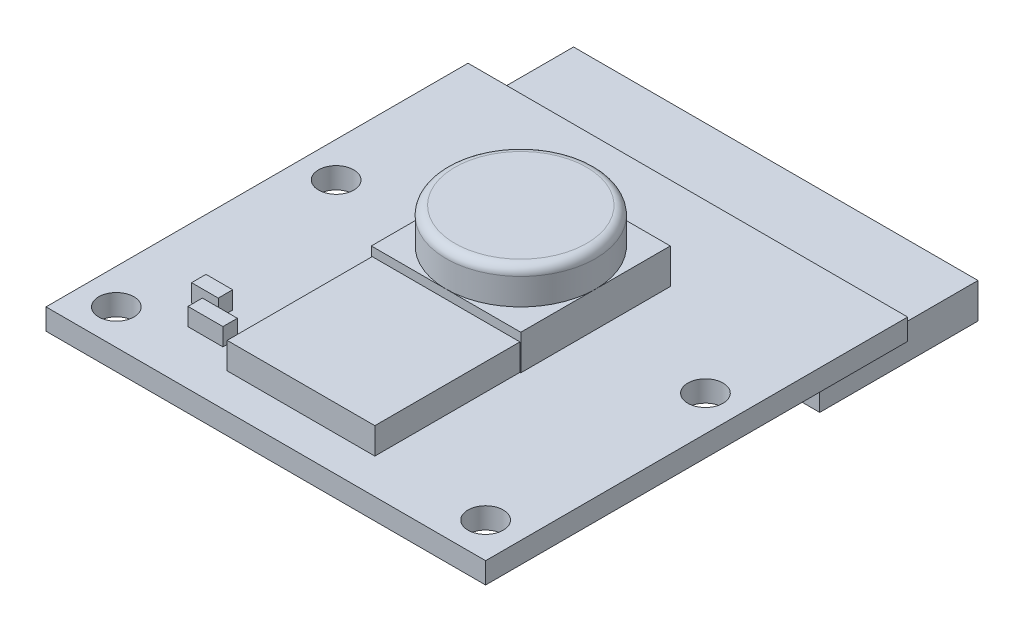
ISO-10303-21;
HEADER;
FILE_DESCRIPTION(('STEP AP214'),'2;1');
FILE_NAME('part.step','',(''),(''),'','','');
FILE_SCHEMA(('AUTOMOTIVE_DESIGN { 1 0 10303 214 1 1 1 1 }'));
ENDSEC;
DATA;
#1=APPLICATION_CONTEXT('core data for automotive mechanical design processes');
#2=APPLICATION_PROTOCOL_DEFINITION('international standard','automotive_design',2000,#1);
#3=PRODUCT_CONTEXT('',#1,'mechanical');
#4=PRODUCT('Part','Part','',(#3));
#5=PRODUCT_RELATED_PRODUCT_CATEGORY('part','',(#4));
#6=PRODUCT_DEFINITION_FORMATION('','',#4);
#7=PRODUCT_DEFINITION_CONTEXT('part definition',#1,'design');
#8=PRODUCT_DEFINITION('design','',#6,#7);
#9=PRODUCT_DEFINITION_SHAPE('','',#8);
#10=(LENGTH_UNIT() NAMED_UNIT(*) SI_UNIT(.MILLI.,.METRE.));
#11=(NAMED_UNIT(*) PLANE_ANGLE_UNIT() SI_UNIT($,.RADIAN.));
#12=(NAMED_UNIT(*) SI_UNIT($,.STERADIAN.) SOLID_ANGLE_UNIT());
#13=UNCERTAINTY_MEASURE_WITH_UNIT(LENGTH_MEASURE(1.E-05),#10,'distance_accuracy_value','');
#14=(GEOMETRIC_REPRESENTATION_CONTEXT(3) GLOBAL_UNCERTAINTY_ASSIGNED_CONTEXT((#13)) GLOBAL_UNIT_ASSIGNED_CONTEXT((#10,
#11,#12)) REPRESENTATION_CONTEXT('',''));
#15=CARTESIAN_POINT('',(0.,0.,0.));
#16=DIRECTION('',(0.,0.,1.));
#17=DIRECTION('',(1.,0.,0.));
#18=AXIS2_PLACEMENT_3D('',#15,#16,#17);
#19=CARTESIAN_POINT('',(0.,3.2,0.));
#20=DIRECTION('',(0.,-1.,0.));
#21=DIRECTION('',(0.,0.,-1.));
#22=AXIS2_PLACEMENT_3D('',#19,#20,#21);
#23=PLANE('',#22);
#24=DIRECTION('',(-1.,0.,0.));
#25=VECTOR('',#24,1.);
#26=CARTESIAN_POINT('',(0.,3.2,-18.75));
#27=LINE('',#26,#25);
#28=CARTESIAN_POINT('',(16.75,3.2,-18.75));
#29=VERTEX_POINT('',#28);
#30=CARTESIAN_POINT('',(12.5,3.2,-18.75));
#31=VERTEX_POINT('',#30);
#32=EDGE_CURVE('E234',#29,#31,#27,.T.);
#33=ORIENTED_EDGE('',*,*,#32,.T.);
#34=CARTESIAN_POINT('',(12.5,3.2,-14.5));
#35=DIRECTION('',(0.,-1.,0.));
#36=DIRECTION('',(0.,0.,-1.));
#37=AXIS2_PLACEMENT_3D('',#34,#35,#36);
#38=CIRCLE('',#37,4.25);
#39=CARTESIAN_POINT('',(16.75,3.2,-14.5));
#40=VERTEX_POINT('',#39);
#41=EDGE_CURVE('E55',#31,#40,#38,.T.);
#42=ORIENTED_EDGE('',*,*,#41,.T.);
#43=DIRECTION('',(0.,0.,-1.));
#44=VECTOR('',#43,1.);
#45=CARTESIAN_POINT('',(16.75,3.2,0.));
#46=LINE('',#45,#44);
#47=EDGE_CURVE('E231',#40,#29,#46,.T.);
#48=ORIENTED_EDGE('',*,*,#47,.T.);
#49=EDGE_LOOP('',(#33,#42,#48));
#50=FACE_BOUND('',#49,.T.);
#51=ADVANCED_FACE('F40',(#50),#23,.F.);
#52=CARTESIAN_POINT('',(16.75,3.2,-10.25));
#53=VERTEX_POINT('',#52);
#54=EDGE_CURVE('E240',#53,#40,#46,.T.);
#55=ORIENTED_EDGE('',*,*,#54,.T.);
#56=CARTESIAN_POINT('',(12.5,3.2,-10.25));
#57=VERTEX_POINT('',#56);
#58=EDGE_CURVE('E219',#40,#57,#38,.T.);
#59=ORIENTED_EDGE('',*,*,#58,.T.);
#60=DIRECTION('',(-1.,0.,0.));
#61=VECTOR('',#60,1.);
#62=CARTESIAN_POINT('',(0.,3.2,-10.25));
#63=LINE('',#62,#61);
#64=EDGE_CURVE('E246',#53,#57,#63,.T.);
#65=ORIENTED_EDGE('',*,*,#64,.F.);
#66=EDGE_LOOP('',(#55,#59,#65));
#67=FACE_BOUND('',#66,.T.);
#68=ADVANCED_FACE('F244',(#67),#23,.F.);
#69=CARTESIAN_POINT('',(8.25,3.2,-10.25));
#70=VERTEX_POINT('',#69);
#71=EDGE_CURVE('E265',#57,#70,#63,.T.);
#72=ORIENTED_EDGE('',*,*,#71,.F.);
#73=CARTESIAN_POINT('',(8.25,3.2,-14.5));
#74=VERTEX_POINT('',#73);
#75=EDGE_CURVE('E222',#57,#74,#38,.T.);
#76=ORIENTED_EDGE('',*,*,#75,.T.);
#77=DIRECTION('',(0.,0.,-1.));
#78=VECTOR('',#77,1.);
#79=CARTESIAN_POINT('',(8.25,3.2,0.));
#80=LINE('',#79,#78);
#81=EDGE_CURVE('E403',#70,#74,#80,.T.);
#82=ORIENTED_EDGE('',*,*,#81,.F.);
#83=EDGE_LOOP('',(#72,#76,#82));
#84=FACE_BOUND('',#83,.T.);
#85=ADVANCED_FACE('F375',(#84),#23,.F.);
#86=CARTESIAN_POINT('',(0.,0.,0.));
#87=DIRECTION('',(0.,1.,0.));
#88=DIRECTION('',(0.,0.,1.));
#89=AXIS2_PLACEMENT_3D('',#86,#87,#88);
#90=PLANE('',#89);
#91=CARTESIAN_POINT('',(2.,0.,-2.));
#92=DIRECTION('',(0.,1.,0.));
#93=DIRECTION('',(0.,0.,1.));
#94=AXIS2_PLACEMENT_3D('',#91,#92,#93);
#95=CIRCLE('',#94,1.);
#96=CARTESIAN_POINT('',(2.,0.,-1.));
#97=VERTEX_POINT('',#96);
#98=EDGE_CURVE('E304',#97,#97,#95,.T.);
#99=ORIENTED_EDGE('',*,*,#98,.T.);
#100=EDGE_LOOP('',(#99));
#101=FACE_BOUND('',#100,.T.);
#102=CARTESIAN_POINT('',(23.,0.,-2.));
#103=DIRECTION('',(0.,1.,0.));
#104=DIRECTION('',(0.,0.,1.));
#105=AXIS2_PLACEMENT_3D('',#102,#103,#104);
#106=CIRCLE('',#105,1.);
#107=CARTESIAN_POINT('',(23.,0.,-1.));
#108=VERTEX_POINT('',#107);
#109=EDGE_CURVE('E342',#108,#108,#106,.T.);
#110=ORIENTED_EDGE('',*,*,#109,.T.);
#111=EDGE_LOOP('',(#110));
#112=FACE_BOUND('',#111,.T.);
#113=CARTESIAN_POINT('',(2.,0.,-14.5));
#114=DIRECTION('',(0.,1.,0.));
#115=DIRECTION('',(0.,0.,1.));
#116=AXIS2_PLACEMENT_3D('',#113,#114,#115);
#117=CIRCLE('',#116,1.);
#118=CARTESIAN_POINT('',(2.,0.,-13.5));
#119=VERTEX_POINT('',#118);
#120=EDGE_CURVE('E339',#119,#119,#117,.T.);
#121=ORIENTED_EDGE('',*,*,#120,.T.);
#122=EDGE_LOOP('',(#121));
#123=FACE_BOUND('',#122,.T.);
#124=CARTESIAN_POINT('',(23.,0.,-14.5));
#125=DIRECTION('',(0.,1.,0.));
#126=DIRECTION('',(0.,0.,1.));
#127=AXIS2_PLACEMENT_3D('',#124,#125,#126);
#128=CIRCLE('',#127,1.);
#129=CARTESIAN_POINT('',(23.,0.,-13.5));
#130=VERTEX_POINT('',#129);
#131=EDGE_CURVE('E336',#130,#130,#128,.T.);
#132=ORIENTED_EDGE('',*,*,#131,.T.);
#133=EDGE_LOOP('',(#132));
#134=FACE_BOUND('',#133,.T.);
#135=DIRECTION('',(0.,0.,1.));
#136=VECTOR('',#135,1.);
#137=CARTESIAN_POINT('',(24.,0.,0.));
#138=LINE('',#137,#136);
#139=CARTESIAN_POINT('',(24.,0.,-24.));
#140=VERTEX_POINT('',#139);
#141=CARTESIAN_POINT('',(24.,0.,-20.));
#142=VERTEX_POINT('',#141);
#143=EDGE_CURVE('E516',#140,#142,#138,.T.);
#144=ORIENTED_EDGE('',*,*,#143,.F.);
#145=DIRECTION('',(1.,0.,0.));
#146=VECTOR('',#145,1.);
#147=CARTESIAN_POINT('',(0.,0.,-24.));
#148=LINE('',#147,#146);
#149=CARTESIAN_POINT('',(25.,0.,-24.));
#150=VERTEX_POINT('',#149);
#151=EDGE_CURVE('E299',#140,#150,#148,.T.);
#152=ORIENTED_EDGE('',*,*,#151,.T.);
#153=DIRECTION('',(0.,0.,1.));
#154=VECTOR('',#153,1.);
#155=CARTESIAN_POINT('',(25.,0.,0.));
#156=LINE('',#155,#154);
#157=CARTESIAN_POINT('',(25.,0.,0.));
#158=VERTEX_POINT('',#157);
#159=EDGE_CURVE('E333',#150,#158,#156,.T.);
#160=ORIENTED_EDGE('',*,*,#159,.T.);
#161=DIRECTION('',(1.,0.,0.));
#162=VECTOR('',#161,1.);
#163=CARTESIAN_POINT('',(0.,0.,0.));
#164=LINE('',#163,#162);
#165=CARTESIAN_POINT('',(0.,0.,0.));
#166=VERTEX_POINT('',#165);
#167=EDGE_CURVE('E330',#166,#158,#164,.T.);
#168=ORIENTED_EDGE('',*,*,#167,.F.);
#169=DIRECTION('',(0.,0.,1.));
#170=VECTOR('',#169,1.);
#171=CARTESIAN_POINT('',(0.,0.,0.));
#172=LINE('',#171,#170);
#173=CARTESIAN_POINT('',(0.,0.,-24.));
#174=VERTEX_POINT('',#173);
#175=EDGE_CURVE('E327',#174,#166,#172,.T.);
#176=ORIENTED_EDGE('',*,*,#175,.F.);
#177=CARTESIAN_POINT('',(1.,0.,-24.));
#178=VERTEX_POINT('',#177);
#179=EDGE_CURVE('E324',#174,#178,#148,.T.);
#180=ORIENTED_EDGE('',*,*,#179,.T.);
#181=DIRECTION('',(0.,0.,1.));
#182=VECTOR('',#181,1.);
#183=CARTESIAN_POINT('',(1.,0.,0.));
#184=LINE('',#183,#182);
#185=CARTESIAN_POINT('',(1.,0.,-20.));
#186=VERTEX_POINT('',#185);
#187=EDGE_CURVE('E355',#178,#186,#184,.T.);
#188=ORIENTED_EDGE('',*,*,#187,.T.);
#189=DIRECTION('',(1.,0.,0.));
#190=VECTOR('',#189,1.);
#191=CARTESIAN_POINT('',(0.,0.,-20.));
#192=LINE('',#191,#190);
#193=EDGE_CURVE('E505',#186,#142,#192,.T.);
#194=ORIENTED_EDGE('',*,*,#193,.T.);
#195=EDGE_LOOP('',(#144,#152,#160,#168,#176,#180,#188,#194));
#196=FACE_BOUND('',#195,.T.);
#197=ADVANCED_FACE('F393',(#101,#112,#123,#134,#196),#90,.F.);
#198=CARTESIAN_POINT('',(0.,1.2,-24.));
#199=DIRECTION('',(0.,0.,-1.));
#200=DIRECTION('',(-1.,0.,0.));
#201=AXIS2_PLACEMENT_3D('',#198,#199,#200);
#202=PLANE('',#201);
#203=ORIENTED_EDGE('',*,*,#179,.F.);
#204=DIRECTION('',(0.,-1.,0.));
#205=VECTOR('',#204,1.);
#206=CARTESIAN_POINT('',(0.,1.2,-24.));
#207=LINE('',#206,#205);
#208=CARTESIAN_POINT('',(0.,1.2,-24.));
#209=VERTEX_POINT('',#208);
#210=EDGE_CURVE('E354',#209,#174,#207,.T.);
#211=ORIENTED_EDGE('',*,*,#210,.F.);
#212=DIRECTION('',(1.,0.,0.));
#213=VECTOR('',#212,1.);
#214=CARTESIAN_POINT('',(0.,1.2,-24.));
#215=LINE('',#214,#213);
#216=CARTESIAN_POINT('',(25.,1.2,-24.));
#217=VERTEX_POINT('',#216);
#218=EDGE_CURVE('E300',#209,#217,#215,.T.);
#219=ORIENTED_EDGE('',*,*,#218,.T.);
#220=DIRECTION('',(0.,-1.,0.));
#221=VECTOR('',#220,1.);
#222=CARTESIAN_POINT('',(25.,1.2,-24.));
#223=LINE('',#222,#221);
#224=EDGE_CURVE('E323',#217,#150,#223,.T.);
#225=ORIENTED_EDGE('',*,*,#224,.T.);
#226=ORIENTED_EDGE('',*,*,#151,.F.);
#227=EDGE_CURVE('E328',#178,#140,#148,.T.);
#228=ORIENTED_EDGE('',*,*,#227,.F.);
#229=EDGE_LOOP('',(#203,#211,#219,#225,#226,#228));
#230=FACE_BOUND('',#229,.T.);
#231=ADVANCED_FACE('F398',(#230),#202,.T.);
#232=CARTESIAN_POINT('',(0.,1.2,0.));
#233=DIRECTION('',(1.,0.,0.));
#234=DIRECTION('',(0.,0.,-1.));
#235=AXIS2_PLACEMENT_3D('',#232,#233,#234);
#236=PLANE('',#235);
#237=ORIENTED_EDGE('',*,*,#175,.T.);
#238=DIRECTION('',(0.,-1.,0.));
#239=VECTOR('',#238,1.);
#240=CARTESIAN_POINT('',(0.,1.2,0.));
#241=LINE('',#240,#239);
#242=CARTESIAN_POINT('',(0.,1.2,0.));
#243=VERTEX_POINT('',#242);
#244=EDGE_CURVE('E351',#243,#166,#241,.T.);
#245=ORIENTED_EDGE('',*,*,#244,.F.);
#246=DIRECTION('',(0.,0.,1.));
#247=VECTOR('',#246,1.);
#248=CARTESIAN_POINT('',(0.,1.2,0.));
#249=LINE('',#248,#247);
#250=EDGE_CURVE('E303',#209,#243,#249,.T.);
#251=ORIENTED_EDGE('',*,*,#250,.F.);
#252=ORIENTED_EDGE('',*,*,#210,.T.);
#253=EDGE_LOOP('',(#237,#245,#251,#252));
#254=FACE_BOUND('',#253,.T.);
#255=ADVANCED_FACE('F563',(#254),#236,.F.);
#256=CARTESIAN_POINT('',(0.,1.2,0.));
#257=DIRECTION('',(0.,0.,-1.));
#258=DIRECTION('',(-1.,0.,0.));
#259=AXIS2_PLACEMENT_3D('',#256,#257,#258);
#260=PLANE('',#259);
#261=ORIENTED_EDGE('',*,*,#167,.T.);
#262=DIRECTION('',(0.,-1.,0.));
#263=VECTOR('',#262,1.);
#264=CARTESIAN_POINT('',(25.,1.2,0.));
#265=LINE('',#264,#263);
#266=CARTESIAN_POINT('',(25.,1.2,0.));
#267=VERTEX_POINT('',#266);
#268=EDGE_CURVE('E349',#267,#158,#265,.T.);
#269=ORIENTED_EDGE('',*,*,#268,.F.);
#270=DIRECTION('',(1.,0.,0.));
#271=VECTOR('',#270,1.);
#272=CARTESIAN_POINT('',(0.,1.2,0.));
#273=LINE('',#272,#271);
#274=EDGE_CURVE('E306',#243,#267,#273,.T.);
#275=ORIENTED_EDGE('',*,*,#274,.F.);
#276=ORIENTED_EDGE('',*,*,#244,.T.);
#277=EDGE_LOOP('',(#261,#269,#275,#276));
#278=FACE_BOUND('',#277,.T.);
#279=ADVANCED_FACE('F558',(#278),#260,.F.);
#280=CARTESIAN_POINT('',(23.,1.2,-2.));
#281=DIRECTION('',(0.,-1.,0.));
#282=DIRECTION('',(0.,0.,-1.));
#283=AXIS2_PLACEMENT_3D('',#280,#281,#282);
#284=CYLINDRICAL_SURFACE('',#283,1.);
#285=CARTESIAN_POINT('',(23.,1.2,-2.));
#286=DIRECTION('',(0.,1.,0.));
#287=DIRECTION('',(0.,0.,1.));
#288=AXIS2_PLACEMENT_3D('',#285,#286,#287);
#289=CIRCLE('',#288,1.);
#290=CARTESIAN_POINT('',(23.,1.2,-1.));
#291=VERTEX_POINT('',#290);
#292=EDGE_CURVE('E317',#291,#291,#289,.T.);
#293=ORIENTED_EDGE('',*,*,#292,.T.);
#294=EDGE_LOOP('',(#293));
#295=FACE_BOUND('',#294,.T.);
#296=ORIENTED_EDGE('',*,*,#109,.F.);
#297=EDGE_LOOP('',(#296));
#298=FACE_BOUND('',#297,.T.);
#299=ADVANCED_FACE('F599',(#295,#298),#284,.F.);
#300=CARTESIAN_POINT('',(2.,1.2,-14.5));
#301=DIRECTION('',(0.,-1.,0.));
#302=DIRECTION('',(0.,0.,-1.));
#303=AXIS2_PLACEMENT_3D('',#300,#301,#302);
#304=CYLINDRICAL_SURFACE('',#303,1.);
#305=CARTESIAN_POINT('',(2.,1.2,-14.5));
#306=DIRECTION('',(0.,1.,0.));
#307=DIRECTION('',(0.,0.,1.));
#308=AXIS2_PLACEMENT_3D('',#305,#306,#307);
#309=CIRCLE('',#308,1.);
#310=CARTESIAN_POINT('',(2.,1.2,-13.5));
#311=VERTEX_POINT('',#310);
#312=EDGE_CURVE('E314',#311,#311,#309,.T.);
#313=ORIENTED_EDGE('',*,*,#312,.T.);
#314=EDGE_LOOP('',(#313));
#315=FACE_BOUND('',#314,.T.);
#316=ORIENTED_EDGE('',*,*,#120,.F.);
#317=EDGE_LOOP('',(#316));
#318=FACE_BOUND('',#317,.T.);
#319=ADVANCED_FACE('F591',(#315,#318),#304,.F.);
#320=CARTESIAN_POINT('',(23.,1.2,-14.5));
#321=DIRECTION('',(0.,-1.,0.));
#322=DIRECTION('',(0.,0.,-1.));
#323=AXIS2_PLACEMENT_3D('',#320,#321,#322);
#324=CYLINDRICAL_SURFACE('',#323,1.);
#325=CARTESIAN_POINT('',(23.,1.2,-14.5));
#326=DIRECTION('',(0.,1.,0.));
#327=DIRECTION('',(0.,0.,1.));
#328=AXIS2_PLACEMENT_3D('',#325,#326,#327);
#329=CIRCLE('',#328,1.);
#330=CARTESIAN_POINT('',(23.,1.2,-13.5));
#331=VERTEX_POINT('',#330);
#332=EDGE_CURVE('E311',#331,#331,#329,.T.);
#333=ORIENTED_EDGE('',*,*,#332,.T.);
#334=EDGE_LOOP('',(#333));
#335=FACE_BOUND('',#334,.T.);
#336=ORIENTED_EDGE('',*,*,#131,.F.);
#337=EDGE_LOOP('',(#336));
#338=FACE_BOUND('',#337,.T.);
#339=ADVANCED_FACE('F589',(#335,#338),#324,.F.);
#340=CARTESIAN_POINT('',(25.,1.2,0.));
#341=DIRECTION('',(1.,0.,0.));
#342=DIRECTION('',(0.,0.,-1.));
#343=AXIS2_PLACEMENT_3D('',#340,#341,#342);
#344=PLANE('',#343);
#345=ORIENTED_EDGE('',*,*,#159,.F.);
#346=ORIENTED_EDGE('',*,*,#224,.F.);
#347=DIRECTION('',(0.,0.,1.));
#348=VECTOR('',#347,1.);
#349=CARTESIAN_POINT('',(25.,1.2,0.));
#350=LINE('',#349,#348);
#351=EDGE_CURVE('E308',#217,#267,#350,.T.);
#352=ORIENTED_EDGE('',*,*,#351,.T.);
#353=ORIENTED_EDGE('',*,*,#268,.T.);
#354=EDGE_LOOP('',(#345,#346,#352,#353));
#355=FACE_BOUND('',#354,.T.);
#356=ADVANCED_FACE('F554',(#355),#344,.T.);
#357=CARTESIAN_POINT('',(2.,1.2,-2.));
#358=DIRECTION('',(0.,-1.,0.));
#359=DIRECTION('',(0.,0.,-1.));
#360=AXIS2_PLACEMENT_3D('',#357,#358,#359);
#361=CYLINDRICAL_SURFACE('',#360,1.);
#362=CARTESIAN_POINT('',(2.,1.2,-2.));
#363=DIRECTION('',(0.,1.,0.));
#364=DIRECTION('',(0.,0.,1.));
#365=AXIS2_PLACEMENT_3D('',#362,#363,#364);
#366=CIRCLE('',#365,1.);
#367=CARTESIAN_POINT('',(2.,1.2,-1.));
#368=VERTEX_POINT('',#367);
#369=EDGE_CURVE('E320',#368,#368,#366,.T.);
#370=ORIENTED_EDGE('',*,*,#369,.T.);
#371=EDGE_LOOP('',(#370));
#372=FACE_BOUND('',#371,.T.);
#373=ORIENTED_EDGE('',*,*,#98,.F.);
#374=EDGE_LOOP('',(#373));
#375=FACE_BOUND('',#374,.T.);
#376=ADVANCED_FACE('F567',(#372,#375),#361,.F.);
#377=CARTESIAN_POINT('',(0.,1.2,0.));
#378=DIRECTION('',(0.,1.,0.));
#379=DIRECTION('',(0.,0.,1.));
#380=AXIS2_PLACEMENT_3D('',#377,#378,#379);
#381=PLANE('',#380);
#382=DIRECTION('',(0.,0.,-1.));
#383=VECTOR('',#382,1.);
#384=CARTESIAN_POINT('',(5.01373689982055,1.2,0.));
#385=LINE('',#384,#383);
#386=CARTESIAN_POINT('',(5.01373689982055,1.2,-3.05983075160949));
#387=VERTEX_POINT('',#386);
#388=CARTESIAN_POINT('',(5.01373689982055,1.2,-3.87973378478108));
#389=VERTEX_POINT('',#388);
#390=EDGE_CURVE('E485',#387,#389,#385,.T.);
#391=ORIENTED_EDGE('',*,*,#390,.T.);
#392=DIRECTION('',(-1.,0.,0.));
#393=VECTOR('',#392,1.);
#394=CARTESIAN_POINT('',(0.,1.2,-3.87973378478108));
#395=LINE('',#394,#393);
#396=CARTESIAN_POINT('',(7.00200175526164,1.2,-3.87973378478108));
#397=VERTEX_POINT('',#396);
#398=EDGE_CURVE('E482',#397,#389,#395,.T.);
#399=ORIENTED_EDGE('',*,*,#398,.F.);
#400=DIRECTION('',(0.,0.,-1.));
#401=VECTOR('',#400,1.);
#402=CARTESIAN_POINT('',(7.00200175526164,1.2,0.));
#403=LINE('',#402,#401);
#404=CARTESIAN_POINT('',(7.00200175526164,1.2,-3.05983075160949));
#405=VERTEX_POINT('',#404);
#406=EDGE_CURVE('E479',#405,#397,#403,.T.);
#407=ORIENTED_EDGE('',*,*,#406,.F.);
#408=DIRECTION('',(-1.,0.,0.));
#409=VECTOR('',#408,1.);
#410=CARTESIAN_POINT('',(0.,1.2,-3.05983075160949));
#411=LINE('',#410,#409);
#412=EDGE_CURVE('E475',#405,#387,#411,.T.);
#413=ORIENTED_EDGE('',*,*,#412,.T.);
#414=EDGE_LOOP('',(#391,#399,#407,#413));
#415=FACE_BOUND('',#414,.T.);
#416=DIRECTION('',(0.,0.,-1.));
#417=VECTOR('',#416,1.);
#418=CARTESIAN_POINT('',(3.94786295669749,1.2,0.));
#419=LINE('',#418,#417);
#420=CARTESIAN_POINT('',(3.94786295669749,1.2,-4.33068045302545));
#421=VERTEX_POINT('',#420);
#422=CARTESIAN_POINT('',(3.94786295669749,1.2,-5.15058348619703));
#423=VERTEX_POINT('',#422);
#424=EDGE_CURVE('E452',#421,#423,#419,.T.);
#425=ORIENTED_EDGE('',*,*,#424,.T.);
#426=DIRECTION('',(-1.,0.,0.));
#427=VECTOR('',#426,1.);
#428=CARTESIAN_POINT('',(0.,1.2,-5.15058348619703));
#429=LINE('',#428,#427);
#430=CARTESIAN_POINT('',(5.46468356806492,1.2,-5.15058348619703));
#431=VERTEX_POINT('',#430);
#432=EDGE_CURVE('E455',#431,#423,#429,.T.);
#433=ORIENTED_EDGE('',*,*,#432,.F.);
#434=DIRECTION('',(0.,0.,-1.));
#435=VECTOR('',#434,1.);
#436=CARTESIAN_POINT('',(5.46468356806492,1.2,0.));
#437=LINE('',#436,#435);
#438=CARTESIAN_POINT('',(5.46468356806492,1.2,-4.33068045302545));
#439=VERTEX_POINT('',#438);
#440=EDGE_CURVE('E457',#439,#431,#437,.T.);
#441=ORIENTED_EDGE('',*,*,#440,.F.);
#442=DIRECTION('',(-1.,0.,0.));
#443=VECTOR('',#442,1.);
#444=CARTESIAN_POINT('',(0.,1.2,-4.33068045302545));
#445=LINE('',#444,#443);
#446=EDGE_CURVE('E435',#439,#421,#445,.T.);
#447=ORIENTED_EDGE('',*,*,#446,.T.);
#448=EDGE_LOOP('',(#425,#433,#441,#447));
#449=FACE_BOUND('',#448,.T.);
#450=DIRECTION('',(-1.,0.,0.));
#451=VECTOR('',#450,1.);
#452=CARTESIAN_POINT('',(0.,1.2,-10.25));
#453=LINE('',#452,#451);
#454=CARTESIAN_POINT('',(8.3,1.2,-10.25));
#455=VERTEX_POINT('',#454);
#456=CARTESIAN_POINT('',(8.25,1.2,-10.25));
#457=VERTEX_POINT('',#456);
#458=EDGE_CURVE('E257',#455,#457,#453,.T.);
#459=ORIENTED_EDGE('',*,*,#458,.T.);
#460=DIRECTION('',(0.,0.,-1.));
#461=VECTOR('',#460,1.);
#462=CARTESIAN_POINT('',(8.25,1.2,0.));
#463=LINE('',#462,#461);
#464=CARTESIAN_POINT('',(8.25,1.2,-18.75));
#465=VERTEX_POINT('',#464);
#466=EDGE_CURVE('E256',#457,#465,#463,.T.);
#467=ORIENTED_EDGE('',*,*,#466,.T.);
#468=DIRECTION('',(-1.,0.,0.));
#469=VECTOR('',#468,1.);
#470=CARTESIAN_POINT('',(0.,1.2,-18.75));
#471=LINE('',#470,#469);
#472=CARTESIAN_POINT('',(16.75,1.2,-18.75));
#473=VERTEX_POINT('',#472);
#474=EDGE_CURVE('E260',#473,#465,#471,.T.);
#475=ORIENTED_EDGE('',*,*,#474,.F.);
#476=DIRECTION('',(0.,0.,-1.));
#477=VECTOR('',#476,1.);
#478=CARTESIAN_POINT('',(16.75,1.2,0.));
#479=LINE('',#478,#477);
#480=CARTESIAN_POINT('',(16.75,1.2,-10.25));
#481=VERTEX_POINT('',#480);
#482=EDGE_CURVE('E263',#481,#473,#479,.T.);
#483=ORIENTED_EDGE('',*,*,#482,.F.);
#484=CARTESIAN_POINT('',(16.7,1.2,-10.25));
#485=VERTEX_POINT('',#484);
#486=EDGE_CURVE('E253',#481,#485,#453,.T.);
#487=ORIENTED_EDGE('',*,*,#486,.T.);
#488=DIRECTION('',(0.,0.,1.));
#489=VECTOR('',#488,1.);
#490=CARTESIAN_POINT('',(16.7,1.2,0.));
#491=LINE('',#490,#489);
#492=CARTESIAN_POINT('',(16.7,1.2,-2.));
#493=VERTEX_POINT('',#492);
#494=EDGE_CURVE('E274',#485,#493,#491,.T.);
#495=ORIENTED_EDGE('',*,*,#494,.T.);
#496=DIRECTION('',(-1.,0.,0.));
#497=VECTOR('',#496,1.);
#498=CARTESIAN_POINT('',(0.,1.2,-2.));
#499=LINE('',#498,#497);
#500=CARTESIAN_POINT('',(8.3,1.2,-2.));
#501=VERTEX_POINT('',#500);
#502=EDGE_CURVE('E285',#493,#501,#499,.T.);
#503=ORIENTED_EDGE('',*,*,#502,.T.);
#504=DIRECTION('',(0.,0.,1.));
#505=VECTOR('',#504,1.);
#506=CARTESIAN_POINT('',(8.3,1.2,0.));
#507=LINE('',#506,#505);
#508=EDGE_CURVE('E268',#455,#501,#507,.T.);
#509=ORIENTED_EDGE('',*,*,#508,.F.);
#510=EDGE_LOOP('',(#459,#467,#475,#483,#487,#495,#503,#509));
#511=FACE_BOUND('',#510,.T.);
#512=ORIENTED_EDGE('',*,*,#218,.F.);
#513=ORIENTED_EDGE('',*,*,#250,.T.);
#514=ORIENTED_EDGE('',*,*,#274,.T.);
#515=ORIENTED_EDGE('',*,*,#351,.F.);
#516=EDGE_LOOP('',(#512,#513,#514,#515));
#517=FACE_BOUND('',#516,.T.);
#518=ORIENTED_EDGE('',*,*,#332,.F.);
#519=EDGE_LOOP('',(#518));
#520=FACE_BOUND('',#519,.T.);
#521=ORIENTED_EDGE('',*,*,#312,.F.);
#522=EDGE_LOOP('',(#521));
#523=FACE_BOUND('',#522,.T.);
#524=ORIENTED_EDGE('',*,*,#292,.F.);
#525=EDGE_LOOP('',(#524));
#526=FACE_BOUND('',#525,.T.);
#527=ORIENTED_EDGE('',*,*,#369,.F.);
#528=EDGE_LOOP('',(#527));
#529=FACE_BOUND('',#528,.T.);
#530=ADVANCED_FACE('F423',(#415,#449,#511,#517,#520,#523,#526,#529),#381,.T.);
#531=CARTESIAN_POINT('',(8.3,2.7,0.));
#532=DIRECTION('',(1.,0.,0.));
#533=DIRECTION('',(0.,0.,-1.));
#534=AXIS2_PLACEMENT_3D('',#531,#532,#533);
#535=PLANE('',#534);
#536=ORIENTED_EDGE('',*,*,#508,.T.);
#537=DIRECTION('',(0.,-1.,0.));
#538=VECTOR('',#537,1.);
#539=CARTESIAN_POINT('',(8.3,2.7,-2.));
#540=LINE('',#539,#538);
#541=CARTESIAN_POINT('',(8.3,2.7,-2.));
#542=VERTEX_POINT('',#541);
#543=EDGE_CURVE('E296',#542,#501,#540,.T.);
#544=ORIENTED_EDGE('',*,*,#543,.F.);
#545=DIRECTION('',(0.,0.,1.));
#546=VECTOR('',#545,1.);
#547=CARTESIAN_POINT('',(8.3,2.7,0.));
#548=LINE('',#547,#546);
#549=CARTESIAN_POINT('',(8.3,2.7,-10.25));
#550=VERTEX_POINT('',#549);
#551=EDGE_CURVE('E271',#550,#542,#548,.T.);
#552=ORIENTED_EDGE('',*,*,#551,.F.);
#553=DIRECTION('',(0.,-1.,0.));
#554=VECTOR('',#553,1.);
#555=CARTESIAN_POINT('',(8.3,2.7,-10.25));
#556=LINE('',#555,#554);
#557=EDGE_CURVE('E283',#550,#455,#556,.T.);
#558=ORIENTED_EDGE('',*,*,#557,.T.);
#559=EDGE_LOOP('',(#536,#544,#552,#558));
#560=FACE_BOUND('',#559,.T.);
#561=ADVANCED_FACE('F566',(#560),#535,.F.);
#562=CARTESIAN_POINT('',(0.,2.7,-2.));
#563=DIRECTION('',(0.,0.,1.));
#564=DIRECTION('',(1.,0.,0.));
#565=AXIS2_PLACEMENT_3D('',#562,#563,#564);
#566=PLANE('',#565);
#567=ORIENTED_EDGE('',*,*,#502,.F.);
#568=DIRECTION('',(0.,-1.,0.));
#569=VECTOR('',#568,1.);
#570=CARTESIAN_POINT('',(16.7,2.7,-2.));
#571=LINE('',#570,#569);
#572=CARTESIAN_POINT('',(16.7,2.7,-2.));
#573=VERTEX_POINT('',#572);
#574=EDGE_CURVE('E294',#573,#493,#571,.T.);
#575=ORIENTED_EDGE('',*,*,#574,.F.);
#576=DIRECTION('',(-1.,0.,0.));
#577=VECTOR('',#576,1.);
#578=CARTESIAN_POINT('',(0.,2.7,-2.));
#579=LINE('',#578,#577);
#580=EDGE_CURVE('E273',#573,#542,#579,.T.);
#581=ORIENTED_EDGE('',*,*,#580,.T.);
#582=ORIENTED_EDGE('',*,*,#543,.T.);
#583=EDGE_LOOP('',(#567,#575,#581,#582));
#584=FACE_BOUND('',#583,.T.);
#585=ADVANCED_FACE('F653',(#584),#566,.T.);
#586=CARTESIAN_POINT('',(16.7,2.7,0.));
#587=DIRECTION('',(1.,0.,0.));
#588=DIRECTION('',(0.,0.,-1.));
#589=AXIS2_PLACEMENT_3D('',#586,#587,#588);
#590=PLANE('',#589);
#591=ORIENTED_EDGE('',*,*,#494,.F.);
#592=DIRECTION('',(0.,-1.,0.));
#593=VECTOR('',#592,1.);
#594=CARTESIAN_POINT('',(16.7,2.7,-10.25));
#595=LINE('',#594,#593);
#596=CARTESIAN_POINT('',(16.7,2.7,-10.25));
#597=VERTEX_POINT('',#596);
#598=EDGE_CURVE('E292',#597,#485,#595,.T.);
#599=ORIENTED_EDGE('',*,*,#598,.F.);
#600=DIRECTION('',(0.,0.,1.));
#601=VECTOR('',#600,1.);
#602=CARTESIAN_POINT('',(16.7,2.7,0.));
#603=LINE('',#602,#601);
#604=EDGE_CURVE('E277',#597,#573,#603,.T.);
#605=ORIENTED_EDGE('',*,*,#604,.T.);
#606=ORIENTED_EDGE('',*,*,#574,.T.);
#607=EDGE_LOOP('',(#591,#599,#605,#606));
#608=FACE_BOUND('',#607,.T.);
#609=ADVANCED_FACE('F659',(#608),#590,.T.);
#610=CARTESIAN_POINT('',(0.,2.7,0.));
#611=DIRECTION('',(0.,-1.,0.));
#612=DIRECTION('',(0.,0.,-1.));
#613=AXIS2_PLACEMENT_3D('',#610,#611,#612);
#614=PLANE('',#613);
#615=ORIENTED_EDGE('',*,*,#551,.T.);
#616=ORIENTED_EDGE('',*,*,#580,.F.);
#617=ORIENTED_EDGE('',*,*,#604,.F.);
#618=DIRECTION('',(-1.,0.,0.));
#619=VECTOR('',#618,1.);
#620=CARTESIAN_POINT('',(0.,2.7,-10.25));
#621=LINE('',#620,#619);
#622=EDGE_CURVE('E280',#597,#550,#621,.T.);
#623=ORIENTED_EDGE('',*,*,#622,.T.);
#624=EDGE_LOOP('',(#615,#616,#617,#623));
#625=FACE_BOUND('',#624,.T.);
#626=ADVANCED_FACE('F682',(#625),#614,.F.);
#627=CARTESIAN_POINT('',(0.,3.2,-10.25));
#628=DIRECTION('',(0.,0.,1.));
#629=DIRECTION('',(1.,0.,0.));
#630=AXIS2_PLACEMENT_3D('',#627,#628,#629);
#631=PLANE('',#630);
#632=ORIENTED_EDGE('',*,*,#557,.F.);
#633=ORIENTED_EDGE('',*,*,#622,.F.);
#634=ORIENTED_EDGE('',*,*,#598,.T.);
#635=ORIENTED_EDGE('',*,*,#486,.F.);
#636=DIRECTION('',(0.,-1.,0.));
#637=VECTOR('',#636,1.);
#638=CARTESIAN_POINT('',(16.75,3.2,-10.25));
#639=LINE('',#638,#637);
#640=EDGE_CURVE('E266',#53,#481,#639,.T.);
#641=ORIENTED_EDGE('',*,*,#640,.F.);
#642=ORIENTED_EDGE('',*,*,#64,.T.);
#643=ORIENTED_EDGE('',*,*,#71,.T.);
#644=DIRECTION('',(0.,-1.,0.));
#645=VECTOR('',#644,1.);
#646=CARTESIAN_POINT('',(8.25,3.2,-10.25));
#647=LINE('',#646,#645);
#648=EDGE_CURVE('E247',#70,#457,#647,.T.);
#649=ORIENTED_EDGE('',*,*,#648,.T.);
#650=ORIENTED_EDGE('',*,*,#458,.F.);
#651=EDGE_LOOP('',(#632,#633,#634,#635,#641,#642,#643,#649,#650));
#652=FACE_BOUND('',#651,.T.);
#653=ADVANCED_FACE('F407',(#652),#631,.T.);
#654=CARTESIAN_POINT('',(16.75,3.2,0.));
#655=DIRECTION('',(-1.,0.,0.));
#656=DIRECTION('',(0.,0.,1.));
#657=AXIS2_PLACEMENT_3D('',#654,#655,#656);
#658=PLANE('',#657);
#659=ORIENTED_EDGE('',*,*,#482,.T.);
#660=DIRECTION('',(0.,-1.,0.));
#661=VECTOR('',#660,1.);
#662=CARTESIAN_POINT('',(16.75,3.2,-18.75));
#663=LINE('',#662,#661);
#664=EDGE_CURVE('E242',#29,#473,#663,.T.);
#665=ORIENTED_EDGE('',*,*,#664,.F.);
#666=ORIENTED_EDGE('',*,*,#47,.F.);
#667=ORIENTED_EDGE('',*,*,#54,.F.);
#668=ORIENTED_EDGE('',*,*,#640,.T.);
#669=EDGE_LOOP('',(#659,#665,#666,#667,#668));
#670=FACE_BOUND('',#669,.T.);
#671=ADVANCED_FACE('F239',(#670),#658,.F.);
#672=CARTESIAN_POINT('',(0.,3.2,-18.75));
#673=DIRECTION('',(0.,0.,1.));
#674=DIRECTION('',(1.,0.,0.));
#675=AXIS2_PLACEMENT_3D('',#672,#673,#674);
#676=PLANE('',#675);
#677=ORIENTED_EDGE('',*,*,#474,.T.);
#678=DIRECTION('',(0.,-1.,0.));
#679=VECTOR('',#678,1.);
#680=CARTESIAN_POINT('',(8.25,3.2,-18.75));
#681=LINE('',#680,#679);
#682=CARTESIAN_POINT('',(8.25,3.2,-18.75));
#683=VERTEX_POINT('',#682);
#684=EDGE_CURVE('E248',#683,#465,#681,.T.);
#685=ORIENTED_EDGE('',*,*,#684,.F.);
#686=EDGE_CURVE('E413',#31,#683,#27,.T.);
#687=ORIENTED_EDGE('',*,*,#686,.F.);
#688=ORIENTED_EDGE('',*,*,#32,.F.);
#689=ORIENTED_EDGE('',*,*,#664,.T.);
#690=EDGE_LOOP('',(#677,#685,#687,#688,#689));
#691=FACE_BOUND('',#690,.T.);
#692=ADVANCED_FACE('F388',(#691),#676,.F.);
#693=CARTESIAN_POINT('',(8.25,3.2,0.));
#694=DIRECTION('',(-1.,0.,0.));
#695=DIRECTION('',(0.,0.,1.));
#696=AXIS2_PLACEMENT_3D('',#693,#694,#695);
#697=PLANE('',#696);
#698=ORIENTED_EDGE('',*,*,#466,.F.);
#699=ORIENTED_EDGE('',*,*,#648,.F.);
#700=ORIENTED_EDGE('',*,*,#81,.T.);
#701=EDGE_CURVE('E409',#74,#683,#80,.T.);
#702=ORIENTED_EDGE('',*,*,#701,.T.);
#703=ORIENTED_EDGE('',*,*,#684,.T.);
#704=EDGE_LOOP('',(#698,#699,#700,#702,#703));
#705=FACE_BOUND('',#704,.T.);
#706=ADVANCED_FACE('F380',(#705),#697,.T.);
#707=ORIENTED_EDGE('',*,*,#701,.F.);
#708=EDGE_CURVE('E236',#74,#31,#38,.T.);
#709=ORIENTED_EDGE('',*,*,#708,.T.);
#710=ORIENTED_EDGE('',*,*,#686,.T.);
#711=EDGE_LOOP('',(#707,#709,#710));
#712=FACE_BOUND('',#711,.T.);
#713=ADVANCED_FACE('F371',(#712),#23,.F.);
#714=CARTESIAN_POINT('',(3.94786295669749,2.2,0.));
#715=DIRECTION('',(-1.,0.,0.));
#716=DIRECTION('',(0.,0.,1.));
#717=AXIS2_PLACEMENT_3D('',#714,#715,#716);
#718=PLANE('',#717);
#719=ORIENTED_EDGE('',*,*,#424,.F.);
#720=DIRECTION('',(0.,-1.,0.));
#721=VECTOR('',#720,1.);
#722=CARTESIAN_POINT('',(3.94786295669749,2.2,-4.33068045302545));
#723=LINE('',#722,#721);
#724=CARTESIAN_POINT('',(3.94786295669749,2.2,-4.33068045302545));
#725=VERTEX_POINT('',#724);
#726=EDGE_CURVE('E425',#725,#421,#723,.T.);
#727=ORIENTED_EDGE('',*,*,#726,.F.);
#728=DIRECTION('',(0.,0.,-1.));
#729=VECTOR('',#728,1.);
#730=CARTESIAN_POINT('',(3.94786295669749,2.2,0.));
#731=LINE('',#730,#729);
#732=CARTESIAN_POINT('',(3.94786295669749,2.2,-5.15058348619703));
#733=VERTEX_POINT('',#732);
#734=EDGE_CURVE('E462',#725,#733,#731,.T.);
#735=ORIENTED_EDGE('',*,*,#734,.T.);
#736=DIRECTION('',(0.,-1.,0.));
#737=VECTOR('',#736,1.);
#738=CARTESIAN_POINT('',(3.94786295669749,2.2,-5.15058348619703));
#739=LINE('',#738,#737);
#740=EDGE_CURVE('E411',#733,#423,#739,.T.);
#741=ORIENTED_EDGE('',*,*,#740,.T.);
#742=EDGE_LOOP('',(#719,#727,#735,#741));
#743=FACE_BOUND('',#742,.T.);
#744=ADVANCED_FACE('F379',(#743),#718,.T.);
#745=CARTESIAN_POINT('',(0.,2.2,-4.33068045302545));
#746=DIRECTION('',(0.,0.,1.));
#747=DIRECTION('',(1.,0.,0.));
#748=AXIS2_PLACEMENT_3D('',#745,#746,#747);
#749=PLANE('',#748);
#750=ORIENTED_EDGE('',*,*,#446,.F.);
#751=DIRECTION('',(0.,-1.,0.));
#752=VECTOR('',#751,1.);
#753=CARTESIAN_POINT('',(5.46468356806492,2.2,-4.33068045302545));
#754=LINE('',#753,#752);
#755=CARTESIAN_POINT('',(5.46468356806492,2.2,-4.33068045302545));
#756=VERTEX_POINT('',#755);
#757=EDGE_CURVE('E426',#756,#439,#754,.T.);
#758=ORIENTED_EDGE('',*,*,#757,.F.);
#759=DIRECTION('',(-1.,0.,0.));
#760=VECTOR('',#759,1.);
#761=CARTESIAN_POINT('',(0.,2.2,-4.33068045302545));
#762=LINE('',#761,#760);
#763=EDGE_CURVE('E442',#756,#725,#762,.T.);
#764=ORIENTED_EDGE('',*,*,#763,.T.);
#765=ORIENTED_EDGE('',*,*,#726,.T.);
#766=EDGE_LOOP('',(#750,#758,#764,#765));
#767=FACE_BOUND('',#766,.T.);
#768=ADVANCED_FACE('F386',(#767),#749,.T.);
#769=CARTESIAN_POINT('',(5.46468356806492,2.2,0.));
#770=DIRECTION('',(-1.,0.,0.));
#771=DIRECTION('',(0.,0.,1.));
#772=AXIS2_PLACEMENT_3D('',#769,#770,#771);
#773=PLANE('',#772);
#774=ORIENTED_EDGE('',*,*,#440,.T.);
#775=DIRECTION('',(0.,-1.,0.));
#776=VECTOR('',#775,1.);
#777=CARTESIAN_POINT('',(5.46468356806492,2.2,-5.15058348619703));
#778=LINE('',#777,#776);
#779=CARTESIAN_POINT('',(5.46468356806492,2.2,-5.15058348619703));
#780=VERTEX_POINT('',#779);
#781=EDGE_CURVE('E432',#780,#431,#778,.T.);
#782=ORIENTED_EDGE('',*,*,#781,.F.);
#783=DIRECTION('',(0.,0.,-1.));
#784=VECTOR('',#783,1.);
#785=CARTESIAN_POINT('',(5.46468356806492,2.2,0.));
#786=LINE('',#785,#784);
#787=EDGE_CURVE('E445',#756,#780,#786,.T.);
#788=ORIENTED_EDGE('',*,*,#787,.F.);
#789=ORIENTED_EDGE('',*,*,#757,.T.);
#790=EDGE_LOOP('',(#774,#782,#788,#789));
#791=FACE_BOUND('',#790,.T.);
#792=ADVANCED_FACE('F718',(#791),#773,.F.);
#793=CARTESIAN_POINT('',(0.,2.2,-5.15058348619703));
#794=DIRECTION('',(0.,0.,1.));
#795=DIRECTION('',(1.,0.,0.));
#796=AXIS2_PLACEMENT_3D('',#793,#794,#795);
#797=PLANE('',#796);
#798=ORIENTED_EDGE('',*,*,#432,.T.);
#799=ORIENTED_EDGE('',*,*,#740,.F.);
#800=DIRECTION('',(-1.,0.,0.));
#801=VECTOR('',#800,1.);
#802=CARTESIAN_POINT('',(0.,2.2,-5.15058348619703));
#803=LINE('',#802,#801);
#804=EDGE_CURVE('E448',#780,#733,#803,.T.);
#805=ORIENTED_EDGE('',*,*,#804,.F.);
#806=ORIENTED_EDGE('',*,*,#781,.T.);
#807=EDGE_LOOP('',(#798,#799,#805,#806));
#808=FACE_BOUND('',#807,.T.);
#809=ADVANCED_FACE('F729',(#808),#797,.F.);
#810=CARTESIAN_POINT('',(0.,2.2,0.));
#811=DIRECTION('',(0.,1.,0.));
#812=DIRECTION('',(0.,0.,1.));
#813=AXIS2_PLACEMENT_3D('',#810,#811,#812);
#814=PLANE('',#813);
#815=ORIENTED_EDGE('',*,*,#734,.F.);
#816=ORIENTED_EDGE('',*,*,#763,.F.);
#817=ORIENTED_EDGE('',*,*,#787,.T.);
#818=ORIENTED_EDGE('',*,*,#804,.T.);
#819=EDGE_LOOP('',(#815,#816,#817,#818));
#820=FACE_BOUND('',#819,.T.);
#821=ADVANCED_FACE('F738',(#820),#814,.T.);
#822=CARTESIAN_POINT('',(5.01373689982055,2.2,0.));
#823=DIRECTION('',(-1.,0.,0.));
#824=DIRECTION('',(0.,0.,1.));
#825=AXIS2_PLACEMENT_3D('',#822,#823,#824);
#826=PLANE('',#825);
#827=ORIENTED_EDGE('',*,*,#390,.F.);
#828=DIRECTION('',(0.,-1.,0.));
#829=VECTOR('',#828,1.);
#830=CARTESIAN_POINT('',(5.01373689982055,2.2,-3.05983075160949));
#831=LINE('',#830,#829);
#832=CARTESIAN_POINT('',(5.01373689982055,2.2,-3.05983075160949));
#833=VERTEX_POINT('',#832);
#834=EDGE_CURVE('E456',#833,#387,#831,.T.);
#835=ORIENTED_EDGE('',*,*,#834,.F.);
#836=DIRECTION('',(0.,0.,-1.));
#837=VECTOR('',#836,1.);
#838=CARTESIAN_POINT('',(5.01373689982055,2.2,0.));
#839=LINE('',#838,#837);
#840=CARTESIAN_POINT('',(5.01373689982055,2.2,-3.87973378478108));
#841=VERTEX_POINT('',#840);
#842=EDGE_CURVE('E478',#833,#841,#839,.T.);
#843=ORIENTED_EDGE('',*,*,#842,.T.);
#844=DIRECTION('',(0.,-1.,0.));
#845=VECTOR('',#844,1.);
#846=CARTESIAN_POINT('',(5.01373689982055,2.2,-3.87973378478108));
#847=LINE('',#846,#845);
#848=EDGE_CURVE('E467',#841,#389,#847,.T.);
#849=ORIENTED_EDGE('',*,*,#848,.T.);
#850=EDGE_LOOP('',(#827,#835,#843,#849));
#851=FACE_BOUND('',#850,.T.);
#852=ADVANCED_FACE('F747',(#851),#826,.T.);
#853=CARTESIAN_POINT('',(0.,2.2,-3.05983075160949));
#854=DIRECTION('',(0.,0.,1.));
#855=DIRECTION('',(1.,0.,0.));
#856=AXIS2_PLACEMENT_3D('',#853,#854,#855);
#857=PLANE('',#856);
#858=ORIENTED_EDGE('',*,*,#412,.F.);
#859=DIRECTION('',(0.,-1.,0.));
#860=VECTOR('',#859,1.);
#861=CARTESIAN_POINT('',(7.00200175526164,2.2,-3.05983075160949));
#862=LINE('',#861,#860);
#863=CARTESIAN_POINT('',(7.00200175526164,2.2,-3.05983075160949));
#864=VERTEX_POINT('',#863);
#865=EDGE_CURVE('E472',#864,#405,#862,.T.);
#866=ORIENTED_EDGE('',*,*,#865,.F.);
#867=DIRECTION('',(-1.,0.,0.));
#868=VECTOR('',#867,1.);
#869=CARTESIAN_POINT('',(0.,2.2,-3.05983075160949));
#870=LINE('',#869,#868);
#871=EDGE_CURVE('E470',#864,#833,#870,.T.);
#872=ORIENTED_EDGE('',*,*,#871,.T.);
#873=ORIENTED_EDGE('',*,*,#834,.T.);
#874=EDGE_LOOP('',(#858,#866,#872,#873));
#875=FACE_BOUND('',#874,.T.);
#876=ADVANCED_FACE('F759',(#875),#857,.T.);
#877=CARTESIAN_POINT('',(7.00200175526164,2.2,0.));
#878=DIRECTION('',(-1.,0.,0.));
#879=DIRECTION('',(0.,0.,1.));
#880=AXIS2_PLACEMENT_3D('',#877,#878,#879);
#881=PLANE('',#880);
#882=ORIENTED_EDGE('',*,*,#406,.T.);
#883=DIRECTION('',(0.,-1.,0.));
#884=VECTOR('',#883,1.);
#885=CARTESIAN_POINT('',(7.00200175526164,2.2,-3.87973378478108));
#886=LINE('',#885,#884);
#887=CARTESIAN_POINT('',(7.00200175526164,2.2,-3.87973378478108));
#888=VERTEX_POINT('',#887);
#889=EDGE_CURVE('E469',#888,#397,#886,.T.);
#890=ORIENTED_EDGE('',*,*,#889,.F.);
#891=DIRECTION('',(0.,0.,-1.));
#892=VECTOR('',#891,1.);
#893=CARTESIAN_POINT('',(7.00200175526164,2.2,0.));
#894=LINE('',#893,#892);
#895=EDGE_CURVE('E490',#864,#888,#894,.T.);
#896=ORIENTED_EDGE('',*,*,#895,.F.);
#897=ORIENTED_EDGE('',*,*,#865,.T.);
#898=EDGE_LOOP('',(#882,#890,#896,#897));
#899=FACE_BOUND('',#898,.T.);
#900=ADVANCED_FACE('F770',(#899),#881,.F.);
#901=CARTESIAN_POINT('',(0.,2.2,-3.87973378478108));
#902=DIRECTION('',(0.,0.,1.));
#903=DIRECTION('',(1.,0.,0.));
#904=AXIS2_PLACEMENT_3D('',#901,#902,#903);
#905=PLANE('',#904);
#906=ORIENTED_EDGE('',*,*,#398,.T.);
#907=ORIENTED_EDGE('',*,*,#848,.F.);
#908=DIRECTION('',(-1.,0.,0.));
#909=VECTOR('',#908,1.);
#910=CARTESIAN_POINT('',(0.,2.2,-3.87973378478108));
#911=LINE('',#910,#909);
#912=EDGE_CURVE('E492',#888,#841,#911,.T.);
#913=ORIENTED_EDGE('',*,*,#912,.F.);
#914=ORIENTED_EDGE('',*,*,#889,.T.);
#915=EDGE_LOOP('',(#906,#907,#913,#914));
#916=FACE_BOUND('',#915,.T.);
#917=ADVANCED_FACE('F781',(#916),#905,.F.);
#918=CARTESIAN_POINT('',(0.,2.2,0.));
#919=DIRECTION('',(0.,1.,0.));
#920=DIRECTION('',(0.,0.,1.));
#921=AXIS2_PLACEMENT_3D('',#918,#919,#920);
#922=PLANE('',#921);
#923=ORIENTED_EDGE('',*,*,#842,.F.);
#924=ORIENTED_EDGE('',*,*,#871,.F.);
#925=ORIENTED_EDGE('',*,*,#895,.T.);
#926=ORIENTED_EDGE('',*,*,#912,.T.);
#927=EDGE_LOOP('',(#923,#924,#925,#926));
#928=FACE_BOUND('',#927,.T.);
#929=ADVANCED_FACE('F792',(#928),#922,.T.);
#930=CARTESIAN_POINT('',(24.,-2.,0.));
#931=DIRECTION('',(-1.,0.,0.));
#932=DIRECTION('',(0.,0.,1.));
#933=AXIS2_PLACEMENT_3D('',#930,#931,#932);
#934=PLANE('',#933);
#935=CARTESIAN_POINT('',(24.,0.,-29.));
#936=VERTEX_POINT('',#935);
#937=EDGE_CURVE('E235',#936,#140,#138,.T.);
#938=ORIENTED_EDGE('',*,*,#937,.T.);
#939=ORIENTED_EDGE('',*,*,#143,.T.);
#940=DIRECTION('',(0.,1.,0.));
#941=VECTOR('',#940,1.);
#942=CARTESIAN_POINT('',(24.,-2.,-20.));
#943=LINE('',#942,#941);
#944=CARTESIAN_POINT('',(24.,-2.,-20.));
#945=VERTEX_POINT('',#944);
#946=EDGE_CURVE('E63',#945,#142,#943,.T.);
#947=ORIENTED_EDGE('',*,*,#946,.F.);
#948=DIRECTION('',(0.,0.,1.));
#949=VECTOR('',#948,1.);
#950=CARTESIAN_POINT('',(24.,-2.,0.));
#951=LINE('',#950,#949);
#952=CARTESIAN_POINT('',(24.,-2.,-29.));
#953=VERTEX_POINT('',#952);
#954=EDGE_CURVE('E508',#953,#945,#951,.T.);
#955=ORIENTED_EDGE('',*,*,#954,.F.);
#956=DIRECTION('',(0.,1.,0.));
#957=VECTOR('',#956,1.);
#958=CARTESIAN_POINT('',(24.,-2.,-29.));
#959=LINE('',#958,#957);
#960=EDGE_CURVE('E496',#953,#936,#959,.T.);
#961=ORIENTED_EDGE('',*,*,#960,.T.);
#962=EDGE_LOOP('',(#938,#939,#947,#955,#961));
#963=FACE_BOUND('',#962,.T.);
#964=ADVANCED_FACE('F531',(#963),#934,.F.);
#965=CARTESIAN_POINT('',(0.,-2.,-20.));
#966=DIRECTION('',(0.,0.,1.));
#967=DIRECTION('',(1.,0.,0.));
#968=AXIS2_PLACEMENT_3D('',#965,#966,#967);
#969=PLANE('',#968);
#970=ORIENTED_EDGE('',*,*,#193,.F.);
#971=DIRECTION('',(0.,1.,0.));
#972=VECTOR('',#971,1.);
#973=CARTESIAN_POINT('',(1.,-2.,-20.));
#974=LINE('',#973,#972);
#975=CARTESIAN_POINT('',(1.,-2.,-20.));
#976=VERTEX_POINT('',#975);
#977=EDGE_CURVE('E502',#976,#186,#974,.T.);
#978=ORIENTED_EDGE('',*,*,#977,.F.);
#979=DIRECTION('',(1.,0.,0.));
#980=VECTOR('',#979,1.);
#981=CARTESIAN_POINT('',(0.,-2.,-20.));
#982=LINE('',#981,#980);
#983=EDGE_CURVE('E500',#976,#945,#982,.T.);
#984=ORIENTED_EDGE('',*,*,#983,.T.);
#985=ORIENTED_EDGE('',*,*,#946,.T.);
#986=EDGE_LOOP('',(#970,#978,#984,#985));
#987=FACE_BOUND('',#986,.T.);
#988=ADVANCED_FACE('F533',(#987),#969,.T.);
#989=CARTESIAN_POINT('',(1.,-2.,0.));
#990=DIRECTION('',(-1.,0.,0.));
#991=DIRECTION('',(0.,0.,1.));
#992=AXIS2_PLACEMENT_3D('',#989,#990,#991);
#993=PLANE('',#992);
#994=CARTESIAN_POINT('',(1.,0.,-29.));
#995=VERTEX_POINT('',#994);
#996=EDGE_CURVE('E509',#995,#178,#184,.T.);
#997=ORIENTED_EDGE('',*,*,#996,.F.);
#998=DIRECTION('',(0.,1.,0.));
#999=VECTOR('',#998,1.);
#1000=CARTESIAN_POINT('',(1.,-2.,-29.));
#1001=LINE('',#1000,#999);
#1002=CARTESIAN_POINT('',(1.,-2.,-29.));
#1003=VERTEX_POINT('',#1002);
#1004=EDGE_CURVE('E499',#1003,#995,#1001,.T.);
#1005=ORIENTED_EDGE('',*,*,#1004,.F.);
#1006=DIRECTION('',(0.,0.,1.));
#1007=VECTOR('',#1006,1.);
#1008=CARTESIAN_POINT('',(1.,-2.,0.));
#1009=LINE('',#1008,#1007);
#1010=EDGE_CURVE('E518',#1003,#976,#1009,.T.);
#1011=ORIENTED_EDGE('',*,*,#1010,.T.);
#1012=ORIENTED_EDGE('',*,*,#977,.T.);
#1013=ORIENTED_EDGE('',*,*,#187,.F.);
#1014=EDGE_LOOP('',(#997,#1005,#1011,#1012,#1013));
#1015=FACE_BOUND('',#1014,.T.);
#1016=ADVANCED_FACE('F537',(#1015),#993,.T.);
#1017=CARTESIAN_POINT('',(0.,-2.,-29.));
#1018=DIRECTION('',(0.,0.,1.));
#1019=DIRECTION('',(1.,0.,0.));
#1020=AXIS2_PLACEMENT_3D('',#1017,#1018,#1019);
#1021=PLANE('',#1020);
#1022=DIRECTION('',(1.,0.,0.));
#1023=VECTOR('',#1022,1.);
#1024=CARTESIAN_POINT('',(0.,0.,-29.));
#1025=LINE('',#1024,#1023);
#1026=EDGE_CURVE('E512',#995,#936,#1025,.T.);
#1027=ORIENTED_EDGE('',*,*,#1026,.T.);
#1028=ORIENTED_EDGE('',*,*,#960,.F.);
#1029=DIRECTION('',(1.,0.,0.));
#1030=VECTOR('',#1029,1.);
#1031=CARTESIAN_POINT('',(0.,-2.,-29.));
#1032=LINE('',#1031,#1030);
#1033=EDGE_CURVE('E521',#1003,#953,#1032,.T.);
#1034=ORIENTED_EDGE('',*,*,#1033,.F.);
#1035=ORIENTED_EDGE('',*,*,#1004,.T.);
#1036=EDGE_LOOP('',(#1027,#1028,#1034,#1035));
#1037=FACE_BOUND('',#1036,.T.);
#1038=ADVANCED_FACE('F540',(#1037),#1021,.F.);
#1039=CARTESIAN_POINT('',(0.,-2.,0.));
#1040=DIRECTION('',(0.,1.,0.));
#1041=DIRECTION('',(0.,0.,1.));
#1042=AXIS2_PLACEMENT_3D('',#1039,#1040,#1041);
#1043=PLANE('',#1042);
#1044=ORIENTED_EDGE('',*,*,#954,.T.);
#1045=ORIENTED_EDGE('',*,*,#983,.F.);
#1046=ORIENTED_EDGE('',*,*,#1010,.F.);
#1047=ORIENTED_EDGE('',*,*,#1033,.T.);
#1048=EDGE_LOOP('',(#1044,#1045,#1046,#1047));
#1049=FACE_BOUND('',#1048,.T.);
#1050=ADVANCED_FACE('F526',(#1049),#1043,.F.);
#1051=CARTESIAN_POINT('',(0.,0.,0.));
#1052=DIRECTION('',(0.,1.,0.));
#1053=DIRECTION('',(0.,0.,1.));
#1054=AXIS2_PLACEMENT_3D('',#1051,#1052,#1053);
#1055=PLANE('',#1054);
#1056=ORIENTED_EDGE('',*,*,#996,.T.);
#1057=ORIENTED_EDGE('',*,*,#227,.T.);
#1058=ORIENTED_EDGE('',*,*,#937,.F.);
#1059=ORIENTED_EDGE('',*,*,#1026,.F.);
#1060=EDGE_LOOP('',(#1056,#1057,#1058,#1059));
#1061=FACE_BOUND('',#1060,.T.);
#1062=ADVANCED_FACE('F543',(#1061),#1055,.T.);
#1063=CARTESIAN_POINT('',(12.5,5.2,-14.5));
#1064=DIRECTION('',(0.,-1.,0.));
#1065=DIRECTION('',(0.,0.,-1.));
#1066=AXIS2_PLACEMENT_3D('',#1063,#1064,#1065);
#1067=CYLINDRICAL_SURFACE('',#1066,4.25);
#1068=CARTESIAN_POINT('',(12.5,4.7,-14.5));
#1069=DIRECTION('',(0.,-1.,0.));
#1070=DIRECTION('',(0.,0.,-1.));
#1071=AXIS2_PLACEMENT_3D('',#1068,#1069,#1070);
#1072=CIRCLE('',#1071,4.25);
#1073=CARTESIAN_POINT('',(12.5,4.7,-18.75));
#1074=VERTEX_POINT('',#1073);
#1075=EDGE_CURVE('E48',#1074,#1074,#1072,.T.);
#1076=ORIENTED_EDGE('',*,*,#1075,.T.);
#1077=EDGE_LOOP('',(#1076));
#1078=FACE_BOUND('',#1077,.T.);
#1079=ORIENTED_EDGE('',*,*,#41,.F.);
#1080=ORIENTED_EDGE('',*,*,#708,.F.);
#1081=ORIENTED_EDGE('',*,*,#75,.F.);
#1082=ORIENTED_EDGE('',*,*,#58,.F.);
#1083=EDGE_LOOP('',(#1079,#1080,#1081,#1082));
#1084=FACE_BOUND('',#1083,.T.);
#1085=ADVANCED_FACE('F220',(#1078,#1084),#1067,.T.);
#1086=CARTESIAN_POINT('',(12.5,5.2,-14.5));
#1087=DIRECTION('',(0.,-1.,0.));
#1088=DIRECTION('',(0.,0.,-1.));
#1089=AXIS2_PLACEMENT_3D('',#1086,#1087,#1088);
#1090=PLANE('',#1089);
#1091=CARTESIAN_POINT('',(12.5,5.2,-14.5));
#1092=DIRECTION('',(0.,-1.,0.));
#1093=DIRECTION('',(0.,0.,-1.));
#1094=AXIS2_PLACEMENT_3D('',#1091,#1092,#1093);
#1095=CIRCLE('',#1094,3.75);
#1096=CARTESIAN_POINT('',(12.5,5.2,-18.25));
#1097=VERTEX_POINT('',#1096);
#1098=EDGE_CURVE('E11',#1097,#1097,#1095,.F.);
#1099=ORIENTED_EDGE('',*,*,#1098,.T.);
#1100=EDGE_LOOP('',(#1099));
#1101=FACE_BOUND('',#1100,.T.);
#1102=ADVANCED_FACE('F361',(#1101),#1090,.F.);
#1103=CARTESIAN_POINT('',(12.5,4.7,-14.5));
#1104=DIRECTION('',(0.,-1.,0.));
#1105=DIRECTION('',(0.,0.,-1.));
#1106=AXIS2_PLACEMENT_3D('',#1103,#1104,#1105);
#1107=TOROIDAL_SURFACE('',#1106,3.75,0.5);
#1108=ORIENTED_EDGE('',*,*,#1098,.F.);
#1109=EDGE_LOOP('',(#1108));
#1110=FACE_BOUND('',#1109,.T.);
#1111=ORIENTED_EDGE('',*,*,#1075,.F.);
#1112=EDGE_LOOP('',(#1111));
#1113=FACE_BOUND('',#1112,.T.);
#1114=ADVANCED_FACE('F42',(#1110,#1113),#1107,.T.);
#1115=CLOSED_SHELL('',(#51,#68,#85,#197,#231,#255,#279,#299,#319,#339,#356,#376,#530,#561,#585,
#609,#626,#653,#671,#692,#706,#713,#744,#768,#792,#809,#821,#852,#876,#900,#917,#929,#964,#988,
#1016,#1038,#1050,#1062,#1085,#1102,#1114));
#1116=MANIFOLD_SOLID_BREP('B2',#1115);
#1117=ADVANCED_BREP_SHAPE_REPRESENTATION('',(#18,#1116),#14);
#1118=SHAPE_DEFINITION_REPRESENTATION(#9,#1117);
ENDSEC;
END-ISO-10303-21;
